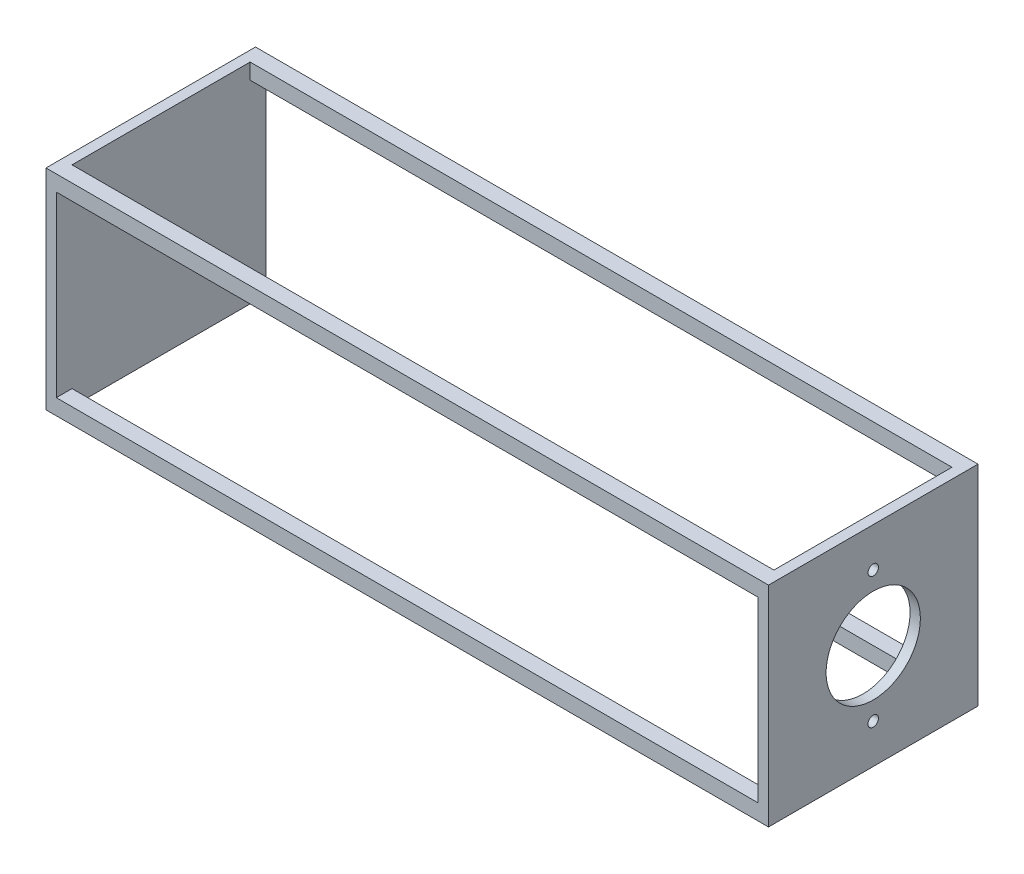
ISO-10303-21;
HEADER;
FILE_DESCRIPTION(('STEP AP214'),'2;1');
FILE_NAME('part.step','',(''),(''),'','','');
FILE_SCHEMA(('AUTOMOTIVE_DESIGN { 1 0 10303 214 1 1 1 1 }'));
ENDSEC;
DATA;
#1=APPLICATION_CONTEXT('core data for automotive mechanical design processes');
#2=APPLICATION_PROTOCOL_DEFINITION('international standard','automotive_design',2000,#1);
#3=PRODUCT_CONTEXT('',#1,'mechanical');
#4=PRODUCT('Part','Part','',(#3));
#5=PRODUCT_RELATED_PRODUCT_CATEGORY('part','',(#4));
#6=PRODUCT_DEFINITION_FORMATION('','',#4);
#7=PRODUCT_DEFINITION_CONTEXT('part definition',#1,'design');
#8=PRODUCT_DEFINITION('design','',#6,#7);
#9=PRODUCT_DEFINITION_SHAPE('','',#8);
#10=(LENGTH_UNIT() NAMED_UNIT(*) SI_UNIT(.MILLI.,.METRE.));
#11=(NAMED_UNIT(*) PLANE_ANGLE_UNIT() SI_UNIT($,.RADIAN.));
#12=(NAMED_UNIT(*) SI_UNIT($,.STERADIAN.) SOLID_ANGLE_UNIT());
#13=UNCERTAINTY_MEASURE_WITH_UNIT(LENGTH_MEASURE(1.E-05),#10,'distance_accuracy_value','');
#14=(GEOMETRIC_REPRESENTATION_CONTEXT(3) GLOBAL_UNCERTAINTY_ASSIGNED_CONTEXT((#13)) GLOBAL_UNIT_ASSIGNED_CONTEXT((#10,
#11,#12)) REPRESENTATION_CONTEXT('',''));
#15=CARTESIAN_POINT('',(0.,0.,0.));
#16=DIRECTION('',(0.,0.,1.));
#17=DIRECTION('',(1.,0.,0.));
#18=AXIS2_PLACEMENT_3D('',#15,#16,#17);
#19=CARTESIAN_POINT('',(-85.09,-25.4,21.59));
#20=DIRECTION('',(0.,0.,1.));
#21=DIRECTION('',(1.,0.,0.));
#22=AXIS2_PLACEMENT_3D('',#19,#20,#21);
#23=PLANE('',#22);
#24=DIRECTION('',(0.,1.,0.));
#25=VECTOR('',#24,1.);
#26=CARTESIAN_POINT('',(-85.09,-25.4,21.59));
#27=LINE('',#26,#25);
#28=CARTESIAN_POINT('',(-85.09,-25.4,21.59));
#29=VERTEX_POINT('',#28);
#30=CARTESIAN_POINT('',(-85.09,-21.5900000000001,21.59));
#31=VERTEX_POINT('',#30);
#32=EDGE_CURVE('E261',#29,#31,#27,.T.);
#33=ORIENTED_EDGE('',*,*,#32,.T.);
#34=DIRECTION('',(1.,0.,0.));
#35=VECTOR('',#34,1.);
#36=CARTESIAN_POINT('',(-85.09,-21.5900000000001,21.59));
#37=LINE('',#36,#35);
#38=CARTESIAN_POINT('',(85.09,-21.5900000000001,21.59));
#39=VERTEX_POINT('',#38);
#40=EDGE_CURVE('E206',#31,#39,#37,.T.);
#41=ORIENTED_EDGE('',*,*,#40,.T.);
#42=DIRECTION('',(0.,1.,0.));
#43=VECTOR('',#42,1.);
#44=CARTESIAN_POINT('',(85.09,-25.4,21.59));
#45=LINE('',#44,#43);
#46=CARTESIAN_POINT('',(85.09,-25.4,21.59));
#47=VERTEX_POINT('',#46);
#48=EDGE_CURVE('E256',#47,#39,#45,.T.);
#49=ORIENTED_EDGE('',*,*,#48,.F.);
#50=DIRECTION('',(1.,0.,0.));
#51=VECTOR('',#50,1.);
#52=CARTESIAN_POINT('',(-85.09,-25.4,21.59));
#53=LINE('',#52,#51);
#54=EDGE_CURVE('E244',#29,#47,#53,.T.);
#55=ORIENTED_EDGE('',*,*,#54,.F.);
#56=EDGE_LOOP('',(#33,#41,#49,#55));
#57=FACE_BOUND('',#56,.T.);
#58=ADVANCED_FACE('F43',(#57),#23,.F.);
#59=CARTESIAN_POINT('',(-85.09,-25.4,-21.59));
#60=DIRECTION('',(0.,0.,-1.));
#61=DIRECTION('',(-1.,0.,0.));
#62=AXIS2_PLACEMENT_3D('',#59,#60,#61);
#63=PLANE('',#62);
#64=DIRECTION('',(0.,1.,0.));
#65=VECTOR('',#64,1.);
#66=CARTESIAN_POINT('',(85.09,-25.4,-21.59));
#67=LINE('',#66,#65);
#68=CARTESIAN_POINT('',(85.09,-25.4,-21.59));
#69=VERTEX_POINT('',#68);
#70=CARTESIAN_POINT('',(85.09,-21.5899999999999,-21.59));
#71=VERTEX_POINT('',#70);
#72=EDGE_CURVE('E269',#69,#71,#67,.T.);
#73=ORIENTED_EDGE('',*,*,#72,.T.);
#74=DIRECTION('',(-1.,0.,0.));
#75=VECTOR('',#74,1.);
#76=CARTESIAN_POINT('',(-85.09,-21.5899999999999,-21.59));
#77=LINE('',#76,#75);
#78=CARTESIAN_POINT('',(-85.09,-21.5899999999999,-21.59));
#79=VERTEX_POINT('',#78);
#80=EDGE_CURVE('E11',#71,#79,#77,.T.);
#81=ORIENTED_EDGE('',*,*,#80,.T.);
#82=DIRECTION('',(0.,1.,0.));
#83=VECTOR('',#82,1.);
#84=CARTESIAN_POINT('',(-85.09,-25.4,-21.59));
#85=LINE('',#84,#83);
#86=CARTESIAN_POINT('',(-85.09,-25.4,-21.59));
#87=VERTEX_POINT('',#86);
#88=EDGE_CURVE('E265',#87,#79,#85,.T.);
#89=ORIENTED_EDGE('',*,*,#88,.F.);
#90=DIRECTION('',(-1.,0.,0.));
#91=VECTOR('',#90,1.);
#92=CARTESIAN_POINT('',(-85.09,-25.4,-21.59));
#93=LINE('',#92,#91);
#94=EDGE_CURVE('E237',#69,#87,#93,.T.);
#95=ORIENTED_EDGE('',*,*,#94,.F.);
#96=EDGE_LOOP('',(#73,#81,#89,#95));
#97=FACE_BOUND('',#96,.T.);
#98=ADVANCED_FACE('F354',(#97),#63,.F.);
#99=CARTESIAN_POINT('',(-87.5909888387275,-25.4,-25.4));
#100=DIRECTION('',(0.,-1.,0.));
#101=DIRECTION('',(0.,0.,-1.));
#102=AXIS2_PLACEMENT_3D('',#99,#100,#101);
#103=PLANE('',#102);
#104=DIRECTION('',(0.,0.,-1.));
#105=VECTOR('',#104,1.);
#106=CARTESIAN_POINT('',(85.09,-25.4,-21.59));
#107=LINE('',#106,#105);
#108=EDGE_CURVE('E234',#47,#69,#107,.T.);
#109=ORIENTED_EDGE('',*,*,#108,.T.);
#110=ORIENTED_EDGE('',*,*,#94,.T.);
#111=DIRECTION('',(0.,0.,1.));
#112=VECTOR('',#111,1.);
#113=CARTESIAN_POINT('',(-85.09,-25.4,-21.59));
#114=LINE('',#113,#112);
#115=EDGE_CURVE('E241',#87,#29,#114,.T.);
#116=ORIENTED_EDGE('',*,*,#115,.T.);
#117=ORIENTED_EDGE('',*,*,#54,.T.);
#118=EDGE_LOOP('',(#109,#110,#116,#117));
#119=FACE_BOUND('',#118,.T.);
#120=DIRECTION('',(1.,0.,0.));
#121=VECTOR('',#120,1.);
#122=CARTESIAN_POINT('',(-87.5909888387275,-25.4,25.4));
#123=LINE('',#122,#121);
#124=CARTESIAN_POINT('',(-87.5909888387275,-25.4,25.4));
#125=VERTEX_POINT('',#124);
#126=CARTESIAN_POINT('',(87.5909888387275,-25.4,25.4));
#127=VERTEX_POINT('',#126);
#128=EDGE_CURVE('E287',#125,#127,#123,.T.);
#129=ORIENTED_EDGE('',*,*,#128,.F.);
#130=DIRECTION('',(0.,0.,1.));
#131=VECTOR('',#130,1.);
#132=CARTESIAN_POINT('',(-87.5909888387275,-25.4,-25.4));
#133=LINE('',#132,#131);
#134=CARTESIAN_POINT('',(-87.5909888387275,-25.4,-25.4));
#135=VERTEX_POINT('',#134);
#136=EDGE_CURVE('E312',#135,#125,#133,.T.);
#137=ORIENTED_EDGE('',*,*,#136,.F.);
#138=DIRECTION('',(1.,0.,0.));
#139=VECTOR('',#138,1.);
#140=CARTESIAN_POINT('',(-87.5909888387275,-25.4,-25.4));
#141=LINE('',#140,#139);
#142=CARTESIAN_POINT('',(87.5909888387275,-25.4,-25.4));
#143=VERTEX_POINT('',#142);
#144=EDGE_CURVE('E288',#135,#143,#141,.T.);
#145=ORIENTED_EDGE('',*,*,#144,.T.);
#146=DIRECTION('',(0.,0.,1.));
#147=VECTOR('',#146,1.);
#148=CARTESIAN_POINT('',(87.5909888387275,-25.4,-25.4));
#149=LINE('',#148,#147);
#150=EDGE_CURVE('E301',#143,#127,#149,.T.);
#151=ORIENTED_EDGE('',*,*,#150,.T.);
#152=EDGE_LOOP('',(#129,#137,#145,#151));
#153=FACE_BOUND('',#152,.T.);
#154=ADVANCED_FACE('F45',(#119,#153),#103,.T.);
#155=CARTESIAN_POINT('',(-87.5909888387275,25.4,-25.4));
#156=DIRECTION('',(-1.,0.,0.));
#157=DIRECTION('',(0.,-1.,0.));
#158=AXIS2_PLACEMENT_3D('',#155,#156,#157);
#159=PLANE('',#158);
#160=CARTESIAN_POINT('',(-87.5909888387275,0.,-12.7));
#161=DIRECTION('',(-1.,0.,0.));
#162=DIRECTION('',(0.,0.,1.));
#163=AXIS2_PLACEMENT_3D('',#160,#161,#162);
#164=CIRCLE('',#163,3.175);
#165=CARTESIAN_POINT('',(-87.5909888387275,0.,-9.52500000000002));
#166=VERTEX_POINT('',#165);
#167=EDGE_CURVE('E214',#166,#166,#164,.T.);
#168=ORIENTED_EDGE('',*,*,#167,.F.);
#169=EDGE_LOOP('',(#168));
#170=FACE_BOUND('',#169,.T.);
#171=CARTESIAN_POINT('',(-87.5909888387275,-12.7,0.));
#172=DIRECTION('',(-1.,0.,0.));
#173=DIRECTION('',(0.,1.,0.));
#174=AXIS2_PLACEMENT_3D('',#171,#172,#173);
#175=CIRCLE('',#174,3.175);
#176=CARTESIAN_POINT('',(-87.5909888387275,-9.52500000000002,0.));
#177=VERTEX_POINT('',#176);
#178=EDGE_CURVE('E220',#177,#177,#175,.T.);
#179=ORIENTED_EDGE('',*,*,#178,.F.);
#180=EDGE_LOOP('',(#179));
#181=FACE_BOUND('',#180,.T.);
#182=CARTESIAN_POINT('',(-87.5909888387275,1.33025439009924E-13,12.7));
#183=DIRECTION('',(-1.,0.,0.));
#184=DIRECTION('',(0.,0.,-1.));
#185=AXIS2_PLACEMENT_3D('',#182,#183,#184);
#186=CIRCLE('',#185,3.175);
#187=CARTESIAN_POINT('',(-87.5909888387275,0.,9.52500000000002));
#188=VERTEX_POINT('',#187);
#189=EDGE_CURVE('E209',#188,#188,#186,.T.);
#190=ORIENTED_EDGE('',*,*,#189,.F.);
#191=EDGE_LOOP('',(#190));
#192=FACE_BOUND('',#191,.T.);
#193=CARTESIAN_POINT('',(-87.5909888387275,12.7,0.));
#194=DIRECTION('',(-1.,0.,0.));
#195=DIRECTION('',(0.,-1.,0.));
#196=AXIS2_PLACEMENT_3D('',#193,#194,#195);
#197=CIRCLE('',#196,3.175);
#198=CARTESIAN_POINT('',(-87.5909888387275,9.52500000000002,0.));
#199=VERTEX_POINT('',#198);
#200=EDGE_CURVE('E213',#199,#199,#197,.T.);
#201=ORIENTED_EDGE('',*,*,#200,.F.);
#202=EDGE_LOOP('',(#201));
#203=FACE_BOUND('',#202,.T.);
#204=DIRECTION('',(0.,-1.,0.));
#205=VECTOR('',#204,1.);
#206=CARTESIAN_POINT('',(-87.5909888387275,25.4,25.4));
#207=LINE('',#206,#205);
#208=CARTESIAN_POINT('',(-87.5909888387275,25.4,25.4));
#209=VERTEX_POINT('',#208);
#210=EDGE_CURVE('E292',#209,#125,#207,.T.);
#211=ORIENTED_EDGE('',*,*,#210,.F.);
#212=DIRECTION('',(0.,0.,1.));
#213=VECTOR('',#212,1.);
#214=CARTESIAN_POINT('',(-87.5909888387275,25.4,-25.4));
#215=LINE('',#214,#213);
#216=CARTESIAN_POINT('',(-87.5909888387275,25.4,-25.4));
#217=VERTEX_POINT('',#216);
#218=EDGE_CURVE('E314',#217,#209,#215,.T.);
#219=ORIENTED_EDGE('',*,*,#218,.F.);
#220=DIRECTION('',(0.,-1.,0.));
#221=VECTOR('',#220,1.);
#222=CARTESIAN_POINT('',(-87.5909888387275,25.4,-25.4));
#223=LINE('',#222,#221);
#224=EDGE_CURVE('E298',#217,#135,#223,.T.);
#225=ORIENTED_EDGE('',*,*,#224,.T.);
#226=ORIENTED_EDGE('',*,*,#136,.T.);
#227=EDGE_LOOP('',(#211,#219,#225,#226));
#228=FACE_BOUND('',#227,.T.);
#229=ADVANCED_FACE('F400',(#170,#181,#192,#203,#228),#159,.T.);
#230=CARTESIAN_POINT('',(-87.5909888387275,25.4,-25.4));
#231=DIRECTION('',(0.,1.,0.));
#232=DIRECTION('',(0.,0.,1.));
#233=AXIS2_PLACEMENT_3D('',#230,#231,#232);
#234=PLANE('',#233);
#235=DIRECTION('',(0.,0.,-1.));
#236=VECTOR('',#235,1.);
#237=CARTESIAN_POINT('',(85.09,25.4,-21.59));
#238=LINE('',#237,#236);
#239=CARTESIAN_POINT('',(85.09,25.4,21.59));
#240=VERTEX_POINT('',#239);
#241=CARTESIAN_POINT('',(85.09,25.4,-21.59));
#242=VERTEX_POINT('',#241);
#243=EDGE_CURVE('E231',#240,#242,#238,.T.);
#244=ORIENTED_EDGE('',*,*,#243,.F.);
#245=DIRECTION('',(1.,0.,0.));
#246=VECTOR('',#245,1.);
#247=CARTESIAN_POINT('',(-85.09,25.4,21.59));
#248=LINE('',#247,#246);
#249=CARTESIAN_POINT('',(-85.09,25.4,21.59));
#250=VERTEX_POINT('',#249);
#251=EDGE_CURVE('E238',#250,#240,#248,.T.);
#252=ORIENTED_EDGE('',*,*,#251,.F.);
#253=DIRECTION('',(0.,0.,1.));
#254=VECTOR('',#253,1.);
#255=CARTESIAN_POINT('',(-85.09,25.4,-21.59));
#256=LINE('',#255,#254);
#257=CARTESIAN_POINT('',(-85.09,25.4,-21.59));
#258=VERTEX_POINT('',#257);
#259=EDGE_CURVE('E251',#258,#250,#256,.T.);
#260=ORIENTED_EDGE('',*,*,#259,.F.);
#261=DIRECTION('',(-1.,0.,0.));
#262=VECTOR('',#261,1.);
#263=CARTESIAN_POINT('',(-85.09,25.4,-21.59));
#264=LINE('',#263,#262);
#265=EDGE_CURVE('E248',#242,#258,#264,.T.);
#266=ORIENTED_EDGE('',*,*,#265,.F.);
#267=EDGE_LOOP('',(#244,#252,#260,#266));
#268=FACE_BOUND('',#267,.T.);
#269=DIRECTION('',(-1.,0.,0.));
#270=VECTOR('',#269,1.);
#271=CARTESIAN_POINT('',(-87.5909888387275,25.4,25.4));
#272=LINE('',#271,#270);
#273=CARTESIAN_POINT('',(87.5909888387275,25.4,25.4));
#274=VERTEX_POINT('',#273);
#275=EDGE_CURVE('E307',#274,#209,#272,.T.);
#276=ORIENTED_EDGE('',*,*,#275,.F.);
#277=DIRECTION('',(0.,0.,1.));
#278=VECTOR('',#277,1.);
#279=CARTESIAN_POINT('',(87.5909888387275,25.4,-25.4));
#280=LINE('',#279,#278);
#281=CARTESIAN_POINT('',(87.5909888387275,25.4,-25.4));
#282=VERTEX_POINT('',#281);
#283=EDGE_CURVE('E316',#282,#274,#280,.T.);
#284=ORIENTED_EDGE('',*,*,#283,.F.);
#285=DIRECTION('',(-1.,0.,0.));
#286=VECTOR('',#285,1.);
#287=CARTESIAN_POINT('',(-87.5909888387275,25.4,-25.4));
#288=LINE('',#287,#286);
#289=EDGE_CURVE('E295',#282,#217,#288,.T.);
#290=ORIENTED_EDGE('',*,*,#289,.T.);
#291=ORIENTED_EDGE('',*,*,#218,.T.);
#292=EDGE_LOOP('',(#276,#284,#290,#291));
#293=FACE_BOUND('',#292,.T.);
#294=ADVANCED_FACE('F330',(#268,#293),#234,.T.);
#295=CARTESIAN_POINT('',(87.5909888387275,25.4,-25.4));
#296=DIRECTION('',(1.,0.,0.));
#297=DIRECTION('',(0.,1.,0.));
#298=AXIS2_PLACEMENT_3D('',#295,#296,#297);
#299=PLANE('',#298);
#300=CARTESIAN_POINT('',(87.5909888387275,-15.875,0.));
#301=DIRECTION('',(1.,0.,0.));
#302=DIRECTION('',(0.,0.,-1.));
#303=AXIS2_PLACEMENT_3D('',#300,#301,#302);
#304=CIRCLE('',#303,1.27);
#305=CARTESIAN_POINT('',(87.5909888387275,-15.875,-1.27));
#306=VERTEX_POINT('',#305);
#307=EDGE_CURVE('E278',#306,#306,#304,.T.);
#308=ORIENTED_EDGE('',*,*,#307,.F.);
#309=EDGE_LOOP('',(#308));
#310=FACE_BOUND('',#309,.T.);
#311=CARTESIAN_POINT('',(87.5909888387275,15.875,0.));
#312=DIRECTION('',(1.,0.,0.));
#313=DIRECTION('',(0.,0.,-1.));
#314=AXIS2_PLACEMENT_3D('',#311,#312,#313);
#315=CIRCLE('',#314,1.27);
#316=CARTESIAN_POINT('',(87.5909888387275,15.875,-1.27));
#317=VERTEX_POINT('',#316);
#318=EDGE_CURVE('E279',#317,#317,#315,.T.);
#319=ORIENTED_EDGE('',*,*,#318,.F.);
#320=EDGE_LOOP('',(#319));
#321=FACE_BOUND('',#320,.T.);
#322=CARTESIAN_POINT('',(87.5909888387275,0.,0.));
#323=DIRECTION('',(1.,0.,0.));
#324=DIRECTION('',(0.,0.,-1.));
#325=AXIS2_PLACEMENT_3D('',#322,#323,#324);
#326=CIRCLE('',#325,11.43);
#327=CARTESIAN_POINT('',(87.5909888387275,0.,-11.43));
#328=VERTEX_POINT('',#327);
#329=EDGE_CURVE('E282',#328,#328,#326,.T.);
#330=ORIENTED_EDGE('',*,*,#329,.F.);
#331=EDGE_LOOP('',(#330));
#332=FACE_BOUND('',#331,.T.);
#333=DIRECTION('',(0.,1.,0.));
#334=VECTOR('',#333,1.);
#335=CARTESIAN_POINT('',(87.5909888387275,25.4,25.4));
#336=LINE('',#335,#334);
#337=EDGE_CURVE('E304',#127,#274,#336,.T.);
#338=ORIENTED_EDGE('',*,*,#337,.F.);
#339=ORIENTED_EDGE('',*,*,#150,.F.);
#340=DIRECTION('',(0.,1.,0.));
#341=VECTOR('',#340,1.);
#342=CARTESIAN_POINT('',(87.5909888387275,25.4,-25.4));
#343=LINE('',#342,#341);
#344=EDGE_CURVE('E291',#143,#282,#343,.T.);
#345=ORIENTED_EDGE('',*,*,#344,.T.);
#346=ORIENTED_EDGE('',*,*,#283,.T.);
#347=EDGE_LOOP('',(#338,#339,#345,#346));
#348=FACE_BOUND('',#347,.T.);
#349=ADVANCED_FACE('F398',(#310,#321,#332,#348),#299,.T.);
#350=CARTESIAN_POINT('',(0.,0.,-25.4));
#351=DIRECTION('',(0.,0.,-1.));
#352=DIRECTION('',(-1.,0.,0.));
#353=AXIS2_PLACEMENT_3D('',#350,#351,#352);
#354=PLANE('',#353);
#355=DIRECTION('',(0.,1.,0.));
#356=VECTOR('',#355,1.);
#357=CARTESIAN_POINT('',(85.09,21.5900000000001,-25.4));
#358=LINE('',#357,#356);
#359=CARTESIAN_POINT('',(85.09,-21.5899999999999,-25.4000000000002));
#360=VERTEX_POINT('',#359);
#361=CARTESIAN_POINT('',(85.09,21.5900000000001,-25.4));
#362=VERTEX_POINT('',#361);
#363=EDGE_CURVE('E163',#360,#362,#358,.T.);
#364=ORIENTED_EDGE('',*,*,#363,.T.);
#365=DIRECTION('',(-1.,0.,0.));
#366=VECTOR('',#365,1.);
#367=CARTESIAN_POINT('',(-85.09,21.5900000000001,-25.4));
#368=LINE('',#367,#366);
#369=CARTESIAN_POINT('',(-85.09,21.5900000000001,-25.4));
#370=VERTEX_POINT('',#369);
#371=EDGE_CURVE('E173',#362,#370,#368,.T.);
#372=ORIENTED_EDGE('',*,*,#371,.T.);
#373=DIRECTION('',(0.,-1.,0.));
#374=VECTOR('',#373,1.);
#375=CARTESIAN_POINT('',(-85.09,21.5900000000001,-25.4));
#376=LINE('',#375,#374);
#377=CARTESIAN_POINT('',(-85.09,-21.5899999999999,-25.4000000000002));
#378=VERTEX_POINT('',#377);
#379=EDGE_CURVE('E58',#370,#378,#376,.T.);
#380=ORIENTED_EDGE('',*,*,#379,.T.);
#381=DIRECTION('',(1.,0.,0.));
#382=VECTOR('',#381,1.);
#383=CARTESIAN_POINT('',(-85.09,-21.5899999999999,-25.4000000000002));
#384=LINE('',#383,#382);
#385=EDGE_CURVE('E181',#378,#360,#384,.T.);
#386=ORIENTED_EDGE('',*,*,#385,.T.);
#387=EDGE_LOOP('',(#364,#372,#380,#386));
#388=FACE_BOUND('',#387,.T.);
#389=ORIENTED_EDGE('',*,*,#144,.F.);
#390=ORIENTED_EDGE('',*,*,#224,.F.);
#391=ORIENTED_EDGE('',*,*,#289,.F.);
#392=ORIENTED_EDGE('',*,*,#344,.F.);
#393=EDGE_LOOP('',(#389,#390,#391,#392));
#394=FACE_BOUND('',#393,.T.);
#395=ADVANCED_FACE('F178',(#388,#394),#354,.T.);
#396=CARTESIAN_POINT('',(0.,0.,25.4));
#397=DIRECTION('',(0.,0.,-1.));
#398=DIRECTION('',(-1.,0.,0.));
#399=AXIS2_PLACEMENT_3D('',#396,#397,#398);
#400=PLANE('',#399);
#401=DIRECTION('',(-1.,0.,0.));
#402=VECTOR('',#401,1.);
#403=CARTESIAN_POINT('',(-85.09,21.5899999999999,25.4000000000001));
#404=LINE('',#403,#402);
#405=CARTESIAN_POINT('',(85.09,21.5899999999999,25.4));
#406=VERTEX_POINT('',#405);
#407=CARTESIAN_POINT('',(-85.09,21.5899999999999,25.4000000000001));
#408=VERTEX_POINT('',#407);
#409=EDGE_CURVE('E191',#406,#408,#404,.T.);
#410=ORIENTED_EDGE('',*,*,#409,.F.);
#411=DIRECTION('',(0.,1.,0.));
#412=VECTOR('',#411,1.);
#413=CARTESIAN_POINT('',(85.09,21.5899999999999,25.4000000000001));
#414=LINE('',#413,#412);
#415=CARTESIAN_POINT('',(85.09,-21.5900000000001,25.3999999999999));
#416=VERTEX_POINT('',#415);
#417=EDGE_CURVE('E66',#416,#406,#414,.T.);
#418=ORIENTED_EDGE('',*,*,#417,.F.);
#419=DIRECTION('',(1.,0.,0.));
#420=VECTOR('',#419,1.);
#421=CARTESIAN_POINT('',(-85.09,-21.5900000000001,25.3999999999999));
#422=LINE('',#421,#420);
#423=CARTESIAN_POINT('',(-85.09,-21.5900000000001,25.3999999999999));
#424=VERTEX_POINT('',#423);
#425=EDGE_CURVE('E182',#424,#416,#422,.T.);
#426=ORIENTED_EDGE('',*,*,#425,.F.);
#427=DIRECTION('',(0.,-1.,0.));
#428=VECTOR('',#427,1.);
#429=CARTESIAN_POINT('',(-85.09,21.5899999999999,25.4000000000001));
#430=LINE('',#429,#428);
#431=EDGE_CURVE('E185',#408,#424,#430,.T.);
#432=ORIENTED_EDGE('',*,*,#431,.F.);
#433=EDGE_LOOP('',(#410,#418,#426,#432));
#434=FACE_BOUND('',#433,.T.);
#435=ORIENTED_EDGE('',*,*,#128,.T.);
#436=ORIENTED_EDGE('',*,*,#337,.T.);
#437=ORIENTED_EDGE('',*,*,#275,.T.);
#438=ORIENTED_EDGE('',*,*,#210,.T.);
#439=EDGE_LOOP('',(#435,#436,#437,#438));
#440=FACE_BOUND('',#439,.T.);
#441=ADVANCED_FACE('F342',(#434,#440),#400,.F.);
#442=CARTESIAN_POINT('',(74.8909888387275,0.,0.));
#443=DIRECTION('',(1.,0.,0.));
#444=DIRECTION('',(0.,0.,-1.));
#445=AXIS2_PLACEMENT_3D('',#442,#443,#444);
#446=CYLINDRICAL_SURFACE('',#445,11.43);
#447=CARTESIAN_POINT('',(85.09,0.,0.));
#448=DIRECTION('',(1.,0.,0.));
#449=DIRECTION('',(0.,0.,-1.));
#450=AXIS2_PLACEMENT_3D('',#447,#448,#449);
#451=CIRCLE('',#450,11.43);
#452=CARTESIAN_POINT('',(85.09,0.,-11.43));
#453=VERTEX_POINT('',#452);
#454=EDGE_CURVE('E275',#453,#453,#451,.F.);
#455=ORIENTED_EDGE('',*,*,#454,.T.);
#456=EDGE_LOOP('',(#455));
#457=FACE_BOUND('',#456,.T.);
#458=ORIENTED_EDGE('',*,*,#329,.T.);
#459=EDGE_LOOP('',(#458));
#460=FACE_BOUND('',#459,.T.);
#461=ADVANCED_FACE('F390',(#457,#460),#446,.F.);
#462=CARTESIAN_POINT('',(74.8909888387275,15.875,0.));
#463=DIRECTION('',(1.,0.,0.));
#464=DIRECTION('',(0.,0.,-1.));
#465=AXIS2_PLACEMENT_3D('',#462,#463,#464);
#466=CYLINDRICAL_SURFACE('',#465,1.27);
#467=CARTESIAN_POINT('',(85.09,15.875,0.));
#468=DIRECTION('',(1.,0.,0.));
#469=DIRECTION('',(0.,0.,-1.));
#470=AXIS2_PLACEMENT_3D('',#467,#468,#469);
#471=CIRCLE('',#470,1.27);
#472=CARTESIAN_POINT('',(85.09,15.875,-1.27));
#473=VERTEX_POINT('',#472);
#474=EDGE_CURVE('E272',#473,#473,#471,.F.);
#475=ORIENTED_EDGE('',*,*,#474,.T.);
#476=EDGE_LOOP('',(#475));
#477=FACE_BOUND('',#476,.T.);
#478=ORIENTED_EDGE('',*,*,#318,.T.);
#479=EDGE_LOOP('',(#478));
#480=FACE_BOUND('',#479,.T.);
#481=ADVANCED_FACE('F385',(#477,#480),#466,.F.);
#482=CARTESIAN_POINT('',(74.8909888387275,-15.875,0.));
#483=DIRECTION('',(1.,0.,0.));
#484=DIRECTION('',(0.,0.,-1.));
#485=AXIS2_PLACEMENT_3D('',#482,#483,#484);
#486=CYLINDRICAL_SURFACE('',#485,1.27);
#487=CARTESIAN_POINT('',(85.09,-15.875,0.));
#488=DIRECTION('',(1.,0.,0.));
#489=DIRECTION('',(0.,0.,-1.));
#490=AXIS2_PLACEMENT_3D('',#487,#488,#489);
#491=CIRCLE('',#490,1.27);
#492=CARTESIAN_POINT('',(85.09,-15.875,-1.27));
#493=VERTEX_POINT('',#492);
#494=EDGE_CURVE('E259',#493,#493,#491,.F.);
#495=ORIENTED_EDGE('',*,*,#494,.T.);
#496=EDGE_LOOP('',(#495));
#497=FACE_BOUND('',#496,.T.);
#498=ORIENTED_EDGE('',*,*,#307,.T.);
#499=EDGE_LOOP('',(#498));
#500=FACE_BOUND('',#499,.T.);
#501=ADVANCED_FACE('F379',(#497,#500),#486,.F.);
#502=CARTESIAN_POINT('',(85.09,-25.4,-21.59));
#503=DIRECTION('',(1.,0.,0.));
#504=DIRECTION('',(0.,0.,-1.));
#505=AXIS2_PLACEMENT_3D('',#502,#503,#504);
#506=PLANE('',#505);
#507=CARTESIAN_POINT('',(85.09,21.5900000000001,-21.59));
#508=VERTEX_POINT('',#507);
#509=EDGE_CURVE('E166',#508,#242,#67,.T.);
#510=ORIENTED_EDGE('',*,*,#509,.F.);
#511=DIRECTION('',(0.,0.,1.));
#512=VECTOR('',#511,1.);
#513=CARTESIAN_POINT('',(85.09,21.5900000000001,-25.4));
#514=LINE('',#513,#512);
#515=EDGE_CURVE('E157',#362,#508,#514,.T.);
#516=ORIENTED_EDGE('',*,*,#515,.F.);
#517=ORIENTED_EDGE('',*,*,#363,.F.);
#518=DIRECTION('',(0.,0.,1.));
#519=VECTOR('',#518,1.);
#520=CARTESIAN_POINT('',(85.09,-21.5899999999999,-25.4000000000002));
#521=LINE('',#520,#519);
#522=EDGE_CURVE('E196',#360,#71,#521,.T.);
#523=ORIENTED_EDGE('',*,*,#522,.T.);
#524=ORIENTED_EDGE('',*,*,#72,.F.);
#525=ORIENTED_EDGE('',*,*,#108,.F.);
#526=ORIENTED_EDGE('',*,*,#48,.T.);
#527=EDGE_CURVE('E199',#39,#416,#521,.T.);
#528=ORIENTED_EDGE('',*,*,#527,.T.);
#529=ORIENTED_EDGE('',*,*,#417,.T.);
#530=CARTESIAN_POINT('',(85.09,21.5899999999999,21.59));
#531=VERTEX_POINT('',#530);
#532=EDGE_CURVE('E170',#531,#406,#514,.T.);
#533=ORIENTED_EDGE('',*,*,#532,.F.);
#534=EDGE_CURVE('E260',#531,#240,#45,.T.);
#535=ORIENTED_EDGE('',*,*,#534,.T.);
#536=ORIENTED_EDGE('',*,*,#243,.T.);
#537=EDGE_LOOP('',(#510,#516,#517,#523,#524,#525,#526,#528,#529,#533,#535,#536));
#538=FACE_BOUND('',#537,.T.);
#539=ORIENTED_EDGE('',*,*,#474,.F.);
#540=EDGE_LOOP('',(#539));
#541=FACE_BOUND('',#540,.T.);
#542=ORIENTED_EDGE('',*,*,#494,.F.);
#543=EDGE_LOOP('',(#542));
#544=FACE_BOUND('',#543,.T.);
#545=ORIENTED_EDGE('',*,*,#454,.F.);
#546=EDGE_LOOP('',(#545));
#547=FACE_BOUND('',#546,.T.);
#548=ADVANCED_FACE('F159',(#538,#541,#544,#547),#506,.F.);
#549=ORIENTED_EDGE('',*,*,#534,.F.);
#550=DIRECTION('',(-1.,0.,0.));
#551=VECTOR('',#550,1.);
#552=CARTESIAN_POINT('',(-85.09,21.5899999999999,21.59));
#553=LINE('',#552,#551);
#554=CARTESIAN_POINT('',(-85.09,21.59,21.59));
#555=VERTEX_POINT('',#554);
#556=EDGE_CURVE('E198',#531,#555,#553,.T.);
#557=ORIENTED_EDGE('',*,*,#556,.T.);
#558=EDGE_CURVE('E264',#555,#250,#27,.T.);
#559=ORIENTED_EDGE('',*,*,#558,.T.);
#560=ORIENTED_EDGE('',*,*,#251,.T.);
#561=EDGE_LOOP('',(#549,#557,#559,#560));
#562=FACE_BOUND('',#561,.T.);
#563=ADVANCED_FACE('F334',(#562),#23,.F.);
#564=CARTESIAN_POINT('',(-85.09,-25.4,-21.59));
#565=DIRECTION('',(-1.,0.,0.));
#566=DIRECTION('',(0.,0.,1.));
#567=AXIS2_PLACEMENT_3D('',#564,#565,#566);
#568=PLANE('',#567);
#569=ORIENTED_EDGE('',*,*,#558,.F.);
#570=DIRECTION('',(0.,0.,1.));
#571=VECTOR('',#570,1.);
#572=CARTESIAN_POINT('',(-85.09,21.5900000000001,-25.4));
#573=LINE('',#572,#571);
#574=EDGE_CURVE('E169',#555,#408,#573,.T.);
#575=ORIENTED_EDGE('',*,*,#574,.T.);
#576=ORIENTED_EDGE('',*,*,#431,.T.);
#577=DIRECTION('',(0.,0.,1.));
#578=VECTOR('',#577,1.);
#579=CARTESIAN_POINT('',(-85.09,-21.5899999999999,-25.4000000000002));
#580=LINE('',#579,#578);
#581=EDGE_CURVE('E202',#31,#424,#580,.T.);
#582=ORIENTED_EDGE('',*,*,#581,.F.);
#583=ORIENTED_EDGE('',*,*,#32,.F.);
#584=ORIENTED_EDGE('',*,*,#115,.F.);
#585=ORIENTED_EDGE('',*,*,#88,.T.);
#586=EDGE_CURVE('E200',#378,#79,#580,.T.);
#587=ORIENTED_EDGE('',*,*,#586,.F.);
#588=ORIENTED_EDGE('',*,*,#379,.F.);
#589=CARTESIAN_POINT('',(-85.09,21.5900000000001,-21.59));
#590=VERTEX_POINT('',#589);
#591=EDGE_CURVE('E175',#370,#590,#573,.T.);
#592=ORIENTED_EDGE('',*,*,#591,.T.);
#593=EDGE_CURVE('E268',#590,#258,#85,.T.);
#594=ORIENTED_EDGE('',*,*,#593,.T.);
#595=ORIENTED_EDGE('',*,*,#259,.T.);
#596=EDGE_LOOP('',(#569,#575,#576,#582,#583,#584,#585,#587,#588,#592,#594,#595));
#597=FACE_BOUND('',#596,.T.);
#598=ADVANCED_FACE('F324',(#597),#568,.F.);
#599=ORIENTED_EDGE('',*,*,#593,.F.);
#600=DIRECTION('',(1.,0.,0.));
#601=VECTOR('',#600,1.);
#602=CARTESIAN_POINT('',(-85.09,21.5900000000001,-21.59));
#603=LINE('',#602,#601);
#604=EDGE_CURVE('E51',#590,#508,#603,.T.);
#605=ORIENTED_EDGE('',*,*,#604,.T.);
#606=ORIENTED_EDGE('',*,*,#509,.T.);
#607=ORIENTED_EDGE('',*,*,#265,.T.);
#608=EDGE_LOOP('',(#599,#605,#606,#607));
#609=FACE_BOUND('',#608,.T.);
#610=ADVANCED_FACE('F322',(#609),#63,.F.);
#611=CARTESIAN_POINT('',(-93.9409888387275,12.7,0.));
#612=DIRECTION('',(1.,0.,0.));
#613=DIRECTION('',(0.,1.,0.));
#614=AXIS2_PLACEMENT_3D('',#611,#612,#613);
#615=CYLINDRICAL_SURFACE('',#614,3.175);
#616=CARTESIAN_POINT('',(-93.9409888387275,12.7,0.));
#617=DIRECTION('',(-1.,0.,0.));
#618=DIRECTION('',(0.,-1.,0.));
#619=AXIS2_PLACEMENT_3D('',#616,#617,#618);
#620=CIRCLE('',#619,3.175);
#621=CARTESIAN_POINT('',(-93.9409888387275,9.52500000000003,0.));
#622=VERTEX_POINT('',#621);
#623=EDGE_CURVE('E228',#622,#622,#620,.T.);
#624=ORIENTED_EDGE('',*,*,#623,.F.);
#625=EDGE_LOOP('',(#624));
#626=FACE_BOUND('',#625,.T.);
#627=ORIENTED_EDGE('',*,*,#200,.T.);
#628=EDGE_LOOP('',(#627));
#629=FACE_BOUND('',#628,.T.);
#630=ADVANCED_FACE('F454',(#626,#629),#615,.T.);
#631=CARTESIAN_POINT('',(-93.9409888387275,12.7,0.));
#632=DIRECTION('',(-1.,0.,0.));
#633=DIRECTION('',(0.,-1.,0.));
#634=AXIS2_PLACEMENT_3D('',#631,#632,#633);
#635=PLANE('',#634);
#636=ORIENTED_EDGE('',*,*,#623,.T.);
#637=EDGE_LOOP('',(#636));
#638=FACE_BOUND('',#637,.T.);
#639=ADVANCED_FACE('F458',(#638),#635,.T.);
#640=CARTESIAN_POINT('',(-93.9409888387275,1.33025439009924E-13,12.7));
#641=DIRECTION('',(1.,0.,0.));
#642=DIRECTION('',(0.,0.,-1.));
#643=AXIS2_PLACEMENT_3D('',#640,#641,#642);
#644=CYLINDRICAL_SURFACE('',#643,3.175);
#645=CARTESIAN_POINT('',(-93.9409888387275,1.33025439009924E-13,12.7));
#646=DIRECTION('',(-1.,0.,0.));
#647=DIRECTION('',(0.,0.,-1.));
#648=AXIS2_PLACEMENT_3D('',#645,#646,#647);
#649=CIRCLE('',#648,3.175);
#650=CARTESIAN_POINT('',(-93.9409888387275,0.,9.52500000000003));
#651=VERTEX_POINT('',#650);
#652=EDGE_CURVE('E223',#651,#651,#649,.T.);
#653=ORIENTED_EDGE('',*,*,#652,.F.);
#654=EDGE_LOOP('',(#653));
#655=FACE_BOUND('',#654,.T.);
#656=ORIENTED_EDGE('',*,*,#189,.T.);
#657=EDGE_LOOP('',(#656));
#658=FACE_BOUND('',#657,.T.);
#659=ADVANCED_FACE('F466',(#655,#658),#644,.T.);
#660=CARTESIAN_POINT('',(-93.9409888387275,1.33025439009924E-13,12.7));
#661=DIRECTION('',(-1.,0.,0.));
#662=DIRECTION('',(0.,0.,-1.));
#663=AXIS2_PLACEMENT_3D('',#660,#661,#662);
#664=PLANE('',#663);
#665=ORIENTED_EDGE('',*,*,#652,.T.);
#666=EDGE_LOOP('',(#665));
#667=FACE_BOUND('',#666,.T.);
#668=ADVANCED_FACE('F480',(#667),#664,.T.);
#669=CARTESIAN_POINT('',(-93.9409888387275,-12.7,0.));
#670=DIRECTION('',(1.,0.,0.));
#671=DIRECTION('',(0.,1.,0.));
#672=AXIS2_PLACEMENT_3D('',#669,#670,#671);
#673=CYLINDRICAL_SURFACE('',#672,3.175);
#674=CARTESIAN_POINT('',(-93.9409888387275,-12.7,0.));
#675=DIRECTION('',(-1.,0.,0.));
#676=DIRECTION('',(0.,1.,0.));
#677=AXIS2_PLACEMENT_3D('',#674,#675,#676);
#678=CIRCLE('',#677,3.175);
#679=CARTESIAN_POINT('',(-93.9409888387275,-9.52500000000003,0.));
#680=VERTEX_POINT('',#679);
#681=EDGE_CURVE('E217',#680,#680,#678,.T.);
#682=ORIENTED_EDGE('',*,*,#681,.F.);
#683=EDGE_LOOP('',(#682));
#684=FACE_BOUND('',#683,.T.);
#685=ORIENTED_EDGE('',*,*,#178,.T.);
#686=EDGE_LOOP('',(#685));
#687=FACE_BOUND('',#686,.T.);
#688=ADVANCED_FACE('F489',(#684,#687),#673,.T.);
#689=CARTESIAN_POINT('',(-93.9409888387275,-12.7,0.));
#690=DIRECTION('',(-1.,0.,0.));
#691=DIRECTION('',(0.,1.,0.));
#692=AXIS2_PLACEMENT_3D('',#689,#690,#691);
#693=PLANE('',#692);
#694=ORIENTED_EDGE('',*,*,#681,.T.);
#695=EDGE_LOOP('',(#694));
#696=FACE_BOUND('',#695,.T.);
#697=ADVANCED_FACE('F498',(#696),#693,.T.);
#698=CARTESIAN_POINT('',(-93.9409888387275,0.,-12.7));
#699=DIRECTION('',(1.,0.,0.));
#700=DIRECTION('',(0.,0.,-1.));
#701=AXIS2_PLACEMENT_3D('',#698,#699,#700);
#702=CYLINDRICAL_SURFACE('',#701,3.175);
#703=CARTESIAN_POINT('',(-93.9409888387275,0.,-12.7));
#704=DIRECTION('',(-1.,0.,0.));
#705=DIRECTION('',(0.,0.,1.));
#706=AXIS2_PLACEMENT_3D('',#703,#704,#705);
#707=CIRCLE('',#706,3.175);
#708=CARTESIAN_POINT('',(-93.9409888387275,0.,-9.52500000000003));
#709=VERTEX_POINT('',#708);
#710=EDGE_CURVE('E210',#709,#709,#707,.T.);
#711=ORIENTED_EDGE('',*,*,#710,.F.);
#712=EDGE_LOOP('',(#711));
#713=FACE_BOUND('',#712,.T.);
#714=ORIENTED_EDGE('',*,*,#167,.T.);
#715=EDGE_LOOP('',(#714));
#716=FACE_BOUND('',#715,.T.);
#717=ADVANCED_FACE('F507',(#713,#716),#702,.T.);
#718=CARTESIAN_POINT('',(-93.9409888387275,0.,-12.7));
#719=DIRECTION('',(-1.,0.,0.));
#720=DIRECTION('',(0.,0.,1.));
#721=AXIS2_PLACEMENT_3D('',#718,#719,#720);
#722=PLANE('',#721);
#723=ORIENTED_EDGE('',*,*,#710,.T.);
#724=EDGE_LOOP('',(#723));
#725=FACE_BOUND('',#724,.T.);
#726=ADVANCED_FACE('F363',(#725),#722,.T.);
#727=CARTESIAN_POINT('',(-85.09,21.5900000000001,-25.4));
#728=DIRECTION('',(0.,1.,0.));
#729=DIRECTION('',(0.,0.,1.));
#730=AXIS2_PLACEMENT_3D('',#727,#728,#729);
#731=PLANE('',#730);
#732=ORIENTED_EDGE('',*,*,#591,.F.);
#733=ORIENTED_EDGE('',*,*,#371,.F.);
#734=ORIENTED_EDGE('',*,*,#515,.T.);
#735=ORIENTED_EDGE('',*,*,#604,.F.);
#736=EDGE_LOOP('',(#732,#733,#734,#735));
#737=FACE_BOUND('',#736,.T.);
#738=ADVANCED_FACE('F174',(#737),#731,.F.);
#739=CARTESIAN_POINT('',(-85.09,-21.5899999999999,-25.4000000000002));
#740=DIRECTION('',(0.,-1.,0.));
#741=DIRECTION('',(0.,0.,-1.));
#742=AXIS2_PLACEMENT_3D('',#739,#740,#741);
#743=PLANE('',#742);
#744=ORIENTED_EDGE('',*,*,#522,.F.);
#745=ORIENTED_EDGE('',*,*,#385,.F.);
#746=ORIENTED_EDGE('',*,*,#586,.T.);
#747=ORIENTED_EDGE('',*,*,#80,.F.);
#748=EDGE_LOOP('',(#744,#745,#746,#747));
#749=FACE_BOUND('',#748,.T.);
#750=ADVANCED_FACE('F356',(#749),#743,.F.);
#751=ORIENTED_EDGE('',*,*,#581,.T.);
#752=ORIENTED_EDGE('',*,*,#425,.T.);
#753=ORIENTED_EDGE('',*,*,#527,.F.);
#754=ORIENTED_EDGE('',*,*,#40,.F.);
#755=EDGE_LOOP('',(#751,#752,#753,#754));
#756=FACE_BOUND('',#755,.T.);
#757=ADVANCED_FACE('F345',(#756),#743,.F.);
#758=ORIENTED_EDGE('',*,*,#532,.T.);
#759=ORIENTED_EDGE('',*,*,#409,.T.);
#760=ORIENTED_EDGE('',*,*,#574,.F.);
#761=ORIENTED_EDGE('',*,*,#556,.F.);
#762=EDGE_LOOP('',(#758,#759,#760,#761));
#763=FACE_BOUND('',#762,.T.);
#764=ADVANCED_FACE('F340',(#763),#731,.F.);
#765=CLOSED_SHELL('',(#58,#98,#154,#229,#294,#349,#395,#441,#461,#481,#501,#548,#563,#598,#610,
#630,#639,#659,#668,#688,#697,#717,#726,#738,#750,#757,#764));
#766=MANIFOLD_SOLID_BREP('B2',#765);
#767=ADVANCED_BREP_SHAPE_REPRESENTATION('',(#18,#766),#14);
#768=SHAPE_DEFINITION_REPRESENTATION(#9,#767);
ENDSEC;
END-ISO-10303-21;
